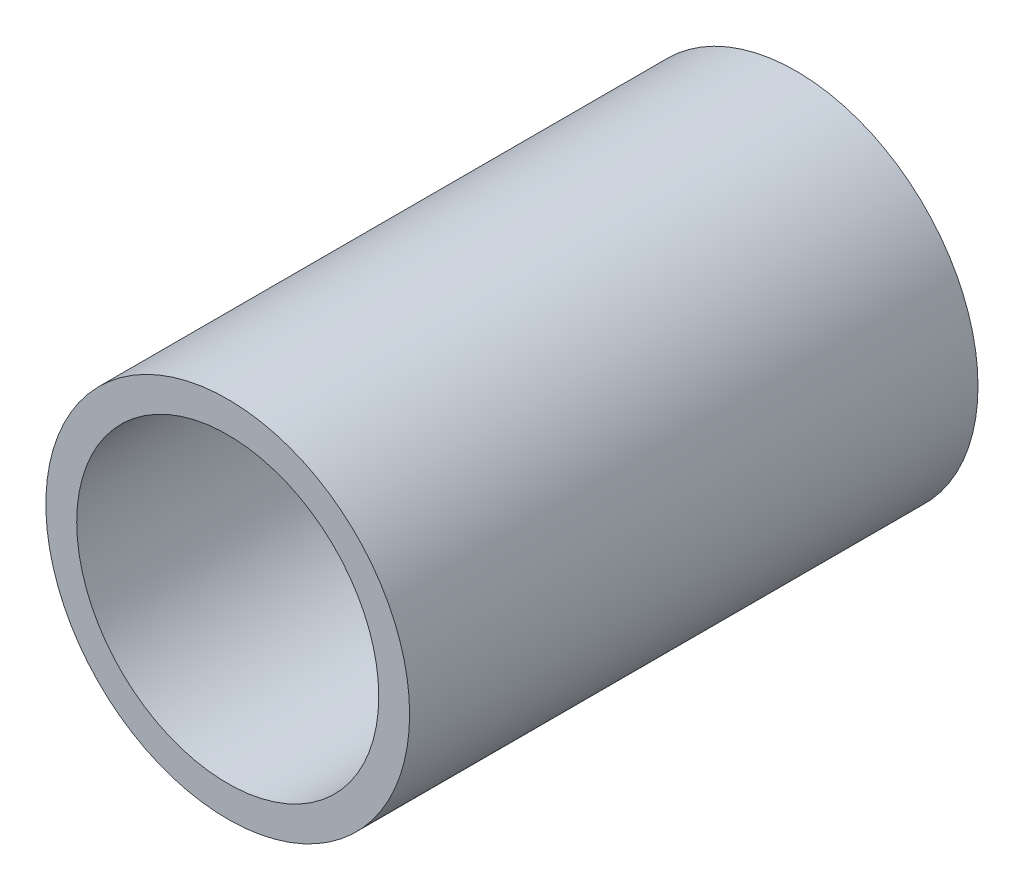
ISO-10303-21;
HEADER;
FILE_DESCRIPTION(('STEP AP214'),'2;1');
FILE_NAME('part.step','',(''),(''),'','','');
FILE_SCHEMA(('AUTOMOTIVE_DESIGN { 1 0 10303 214 1 1 1 1 }'));
ENDSEC;
DATA;
#1=APPLICATION_CONTEXT('core data for automotive mechanical design processes');
#2=APPLICATION_PROTOCOL_DEFINITION('international standard','automotive_design',2000,#1);
#3=PRODUCT_CONTEXT('',#1,'mechanical');
#4=PRODUCT('Part','Part','',(#3));
#5=PRODUCT_RELATED_PRODUCT_CATEGORY('part','',(#4));
#6=PRODUCT_DEFINITION_FORMATION('','',#4);
#7=PRODUCT_DEFINITION_CONTEXT('part definition',#1,'design');
#8=PRODUCT_DEFINITION('design','',#6,#7);
#9=PRODUCT_DEFINITION_SHAPE('','',#8);
#10=(LENGTH_UNIT() NAMED_UNIT(*) SI_UNIT(.MILLI.,.METRE.));
#11=(NAMED_UNIT(*) PLANE_ANGLE_UNIT() SI_UNIT($,.RADIAN.));
#12=(NAMED_UNIT(*) SI_UNIT($,.STERADIAN.) SOLID_ANGLE_UNIT());
#13=UNCERTAINTY_MEASURE_WITH_UNIT(LENGTH_MEASURE(1.E-05),#10,'distance_accuracy_value','');
#14=(GEOMETRIC_REPRESENTATION_CONTEXT(3) GLOBAL_UNCERTAINTY_ASSIGNED_CONTEXT((#13)) GLOBAL_UNIT_ASSIGNED_CONTEXT((#10,
#11,#12)) REPRESENTATION_CONTEXT('',''));
#15=CARTESIAN_POINT('',(0.,0.,0.));
#16=DIRECTION('',(0.,0.,1.));
#17=DIRECTION('',(1.,0.,0.));
#18=AXIS2_PLACEMENT_3D('',#15,#16,#17);
#19=CARTESIAN_POINT('',(0.,0.,50.));
#20=DIRECTION('',(0.,0.,1.));
#21=DIRECTION('',(1.,0.,0.));
#22=AXIS2_PLACEMENT_3D('',#19,#20,#21);
#23=PLANE('',#22);
#24=CARTESIAN_POINT('',(0.,0.,50.));
#25=DIRECTION('',(0.,0.,1.));
#26=DIRECTION('',(1.,0.,0.));
#27=AXIS2_PLACEMENT_3D('',#24,#25,#26);
#28=CIRCLE('',#27,16.);
#29=CARTESIAN_POINT('',(16.,0.,50.));
#30=VERTEX_POINT('',#29);
#31=EDGE_CURVE('E10',#30,#30,#28,.T.);
#32=ORIENTED_EDGE('',*,*,#31,.T.);
#33=EDGE_LOOP('',(#32));
#34=FACE_BOUND('',#33,.T.);
#35=CARTESIAN_POINT('',(0.,0.,50.));
#36=DIRECTION('',(0.,0.,1.));
#37=DIRECTION('',(1.,0.,0.));
#38=AXIS2_PLACEMENT_3D('',#35,#36,#37);
#39=CIRCLE('',#38,13.2855199495501);
#40=CARTESIAN_POINT('',(13.2855199495501,0.,50.));
#41=VERTEX_POINT('',#40);
#42=EDGE_CURVE('E42',#41,#41,#39,.T.);
#43=ORIENTED_EDGE('',*,*,#42,.F.);
#44=EDGE_LOOP('',(#43));
#45=FACE_BOUND('',#44,.T.);
#46=ADVANCED_FACE('F31',(#34,#45),#23,.T.);
#47=CARTESIAN_POINT('',(0.,0.,0.));
#48=DIRECTION('',(0.,0.,1.));
#49=DIRECTION('',(1.,0.,0.));
#50=AXIS2_PLACEMENT_3D('',#47,#48,#49);
#51=PLANE('',#50);
#52=CARTESIAN_POINT('',(0.,0.,0.));
#53=DIRECTION('',(0.,0.,1.));
#54=DIRECTION('',(1.,0.,0.));
#55=AXIS2_PLACEMENT_3D('',#52,#53,#54);
#56=CIRCLE('',#55,16.);
#57=CARTESIAN_POINT('',(16.,0.,0.));
#58=VERTEX_POINT('',#57);
#59=EDGE_CURVE('E35',#58,#58,#56,.T.);
#60=ORIENTED_EDGE('',*,*,#59,.F.);
#61=EDGE_LOOP('',(#60));
#62=FACE_BOUND('',#61,.T.);
#63=CARTESIAN_POINT('',(0.,0.,0.));
#64=DIRECTION('',(0.,0.,1.));
#65=DIRECTION('',(1.,0.,0.));
#66=AXIS2_PLACEMENT_3D('',#63,#64,#65);
#67=CIRCLE('',#66,13.2855199495501);
#68=CARTESIAN_POINT('',(13.2855199495501,0.,0.));
#69=VERTEX_POINT('',#68);
#70=EDGE_CURVE('E44',#69,#69,#67,.T.);
#71=ORIENTED_EDGE('',*,*,#70,.T.);
#72=EDGE_LOOP('',(#71));
#73=FACE_BOUND('',#72,.T.);
#74=ADVANCED_FACE('F54',(#62,#73),#51,.F.);
#75=CARTESIAN_POINT('',(0.,0.,50.));
#76=DIRECTION('',(0.,0.,-1.));
#77=DIRECTION('',(-1.,0.,0.));
#78=AXIS2_PLACEMENT_3D('',#75,#76,#77);
#79=CYLINDRICAL_SURFACE('',#78,16.);
#80=ORIENTED_EDGE('',*,*,#31,.F.);
#81=EDGE_LOOP('',(#80));
#82=FACE_BOUND('',#81,.T.);
#83=ORIENTED_EDGE('',*,*,#59,.T.);
#84=EDGE_LOOP('',(#83));
#85=FACE_BOUND('',#84,.T.);
#86=ADVANCED_FACE('F33',(#82,#85),#79,.T.);
#87=CARTESIAN_POINT('',(0.,0.,50.));
#88=DIRECTION('',(0.,0.,-1.));
#89=DIRECTION('',(-1.,0.,0.));
#90=AXIS2_PLACEMENT_3D('',#87,#88,#89);
#91=CYLINDRICAL_SURFACE('',#90,13.2855199495501);
#92=ORIENTED_EDGE('',*,*,#42,.T.);
#93=EDGE_LOOP('',(#92));
#94=FACE_BOUND('',#93,.T.);
#95=ORIENTED_EDGE('',*,*,#70,.F.);
#96=EDGE_LOOP('',(#95));
#97=FACE_BOUND('',#96,.T.);
#98=ADVANCED_FACE('F50',(#94,#97),#91,.F.);
#99=CLOSED_SHELL('',(#46,#74,#86,#98));
#100=MANIFOLD_SOLID_BREP('B2',#99);
#101=ADVANCED_BREP_SHAPE_REPRESENTATION('',(#18,#100),#14);
#102=SHAPE_DEFINITION_REPRESENTATION(#9,#101);
ENDSEC;
END-ISO-10303-21;
